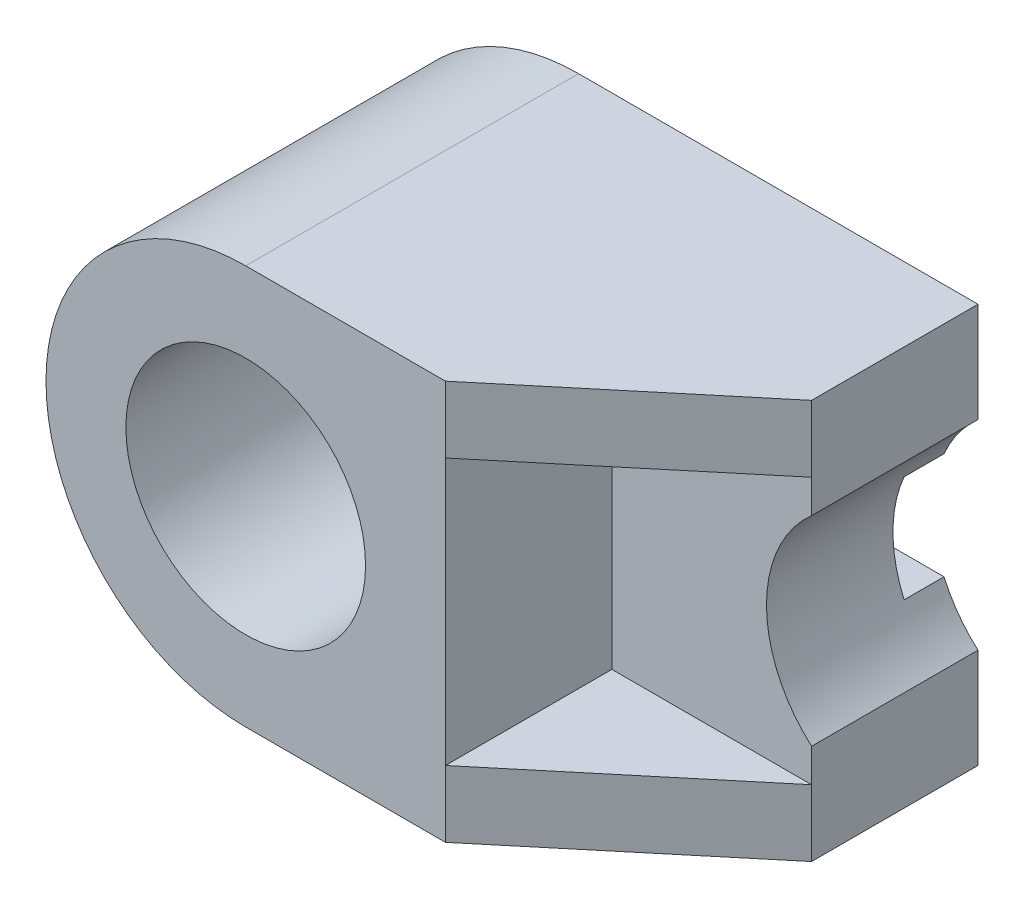
ISO-10303-21;
HEADER;
FILE_DESCRIPTION(('STEP AP214'),'2;1');
FILE_NAME('part.step','',(''),(''),'','','');
FILE_SCHEMA(('AUTOMOTIVE_DESIGN { 1 0 10303 214 1 1 1 1 }'));
ENDSEC;
DATA;
#1=APPLICATION_CONTEXT('core data for automotive mechanical design processes');
#2=APPLICATION_PROTOCOL_DEFINITION('international standard','automotive_design',2000,#1);
#3=PRODUCT_CONTEXT('',#1,'mechanical');
#4=PRODUCT('Part','Part','',(#3));
#5=PRODUCT_RELATED_PRODUCT_CATEGORY('part','',(#4));
#6=PRODUCT_DEFINITION_FORMATION('','',#4);
#7=PRODUCT_DEFINITION_CONTEXT('part definition',#1,'design');
#8=PRODUCT_DEFINITION('design','',#6,#7);
#9=PRODUCT_DEFINITION_SHAPE('','',#8);
#10=(LENGTH_UNIT() NAMED_UNIT(*) SI_UNIT(.MILLI.,.METRE.));
#11=(NAMED_UNIT(*) PLANE_ANGLE_UNIT() SI_UNIT($,.RADIAN.));
#12=(NAMED_UNIT(*) SI_UNIT($,.STERADIAN.) SOLID_ANGLE_UNIT());
#13=UNCERTAINTY_MEASURE_WITH_UNIT(LENGTH_MEASURE(1.E-05),#10,'distance_accuracy_value','');
#14=(GEOMETRIC_REPRESENTATION_CONTEXT(3) GLOBAL_UNCERTAINTY_ASSIGNED_CONTEXT((#13)) GLOBAL_UNIT_ASSIGNED_CONTEXT((#10,
#11,#12)) REPRESENTATION_CONTEXT('',''));
#15=CARTESIAN_POINT('',(0.,0.,0.));
#16=DIRECTION('',(0.,0.,1.));
#17=DIRECTION('',(1.,0.,0.));
#18=AXIS2_PLACEMENT_3D('',#15,#16,#17);
#19=CARTESIAN_POINT('',(0.,0.,-50.));
#20=DIRECTION('',(0.,0.,-1.));
#21=DIRECTION('',(-1.,0.,0.));
#22=AXIS2_PLACEMENT_3D('',#19,#20,#21);
#23=PLANE('',#22);
#24=CARTESIAN_POINT('',(73.228756555323,0.,-50.));
#25=DIRECTION('',(0.,0.,-1.));
#26=DIRECTION('',(-1.,0.,0.));
#27=AXIS2_PLACEMENT_3D('',#24,#25,#26);
#28=CIRCLE('',#27,20.);
#29=CARTESIAN_POINT('',(60.,15.,-50.));
#30=VERTEX_POINT('',#29);
#31=CARTESIAN_POINT('',(54.8984537754996,8.,-50.));
#32=VERTEX_POINT('',#31);
#33=EDGE_CURVE('E291',#30,#32,#28,.F.);
#34=ORIENTED_EDGE('',*,*,#33,.T.);
#35=DIRECTION('',(-1.,0.,0.));
#36=VECTOR('',#35,1.);
#37=CARTESIAN_POINT('',(0.,8.,-50.));
#38=LINE('',#37,#36);
#39=CARTESIAN_POINT('',(16.1245154965971,8.,-50.));
#40=VERTEX_POINT('',#39);
#41=EDGE_CURVE('E188',#32,#40,#38,.T.);
#42=ORIENTED_EDGE('',*,*,#41,.T.);
#43=CARTESIAN_POINT('',(0.,0.,-50.));
#44=DIRECTION('',(0.,0.,1.));
#45=DIRECTION('',(1.,0.,0.));
#46=AXIS2_PLACEMENT_3D('',#43,#44,#45);
#47=CIRCLE('',#46,18.);
#48=CARTESIAN_POINT('',(-16.1245154965971,8.,-50.));
#49=VERTEX_POINT('',#48);
#50=EDGE_CURVE('E318',#40,#49,#47,.T.);
#51=ORIENTED_EDGE('',*,*,#50,.T.);
#52=DIRECTION('',(1.,0.,0.));
#53=VECTOR('',#52,1.);
#54=CARTESIAN_POINT('',(-28.9136645896019,8.,-50.));
#55=LINE('',#54,#53);
#56=CARTESIAN_POINT('',(-28.9136645896019,8.,-50.));
#57=VERTEX_POINT('',#56);
#58=EDGE_CURVE('E215',#57,#49,#55,.T.);
#59=ORIENTED_EDGE('',*,*,#58,.F.);
#60=CARTESIAN_POINT('',(0.,0.,-50.));
#61=DIRECTION('',(0.,0.,1.));
#62=DIRECTION('',(-1.,0.,0.));
#63=AXIS2_PLACEMENT_3D('',#60,#61,#62);
#64=CIRCLE('',#63,30.);
#65=CARTESIAN_POINT('',(0.,30.,-50.));
#66=VERTEX_POINT('',#65);
#67=EDGE_CURVE('E322',#66,#57,#64,.T.);
#68=ORIENTED_EDGE('',*,*,#67,.F.);
#69=DIRECTION('',(-1.,0.,0.));
#70=VECTOR('',#69,1.);
#71=CARTESIAN_POINT('',(0.,30.,-50.));
#72=LINE('',#71,#70);
#73=CARTESIAN_POINT('',(60.,30.,-50.));
#74=VERTEX_POINT('',#73);
#75=EDGE_CURVE('E330',#74,#66,#72,.T.);
#76=ORIENTED_EDGE('',*,*,#75,.F.);
#77=DIRECTION('',(0.,-1.,0.));
#78=VECTOR('',#77,1.);
#79=CARTESIAN_POINT('',(60.,0.,-50.));
#80=LINE('',#79,#78);
#81=EDGE_CURVE('E268',#74,#30,#80,.T.);
#82=ORIENTED_EDGE('',*,*,#81,.T.);
#83=EDGE_LOOP('',(#34,#42,#51,#59,#68,#76,#82));
#84=FACE_BOUND('',#83,.T.);
#85=ADVANCED_FACE('F46',(#84),#23,.T.);
#86=CARTESIAN_POINT('',(0.,0.,-50.));
#87=DIRECTION('',(0.,0.,1.));
#88=DIRECTION('',(1.,0.,0.));
#89=AXIS2_PLACEMENT_3D('',#86,#87,#88);
#90=CYLINDRICAL_SURFACE('',#89,18.);
#91=CARTESIAN_POINT('',(0.,0.,0.));
#92=DIRECTION('',(0.,0.,1.));
#93=DIRECTION('',(1.,0.,0.));
#94=AXIS2_PLACEMENT_3D('',#91,#92,#93);
#95=CIRCLE('',#94,18.);
#96=CARTESIAN_POINT('',(18.,0.,0.));
#97=VERTEX_POINT('',#96);
#98=EDGE_CURVE('E303',#97,#97,#95,.T.);
#99=ORIENTED_EDGE('',*,*,#98,.T.);
#100=EDGE_LOOP('',(#99));
#101=FACE_BOUND('',#100,.T.);
#102=DIRECTION('',(0.,0.,-1.));
#103=VECTOR('',#102,1.);
#104=CARTESIAN_POINT('',(16.1245154965971,8.,-44.));
#105=LINE('',#104,#103);
#106=CARTESIAN_POINT('',(16.1245154965971,8.,-44.));
#107=VERTEX_POINT('',#106);
#108=EDGE_CURVE('E198',#107,#40,#105,.T.);
#109=ORIENTED_EDGE('',*,*,#108,.F.);
#110=CARTESIAN_POINT('',(0.,0.,-44.));
#111=DIRECTION('',(0.,0.,-1.));
#112=DIRECTION('',(-1.,0.,0.));
#113=AXIS2_PLACEMENT_3D('',#110,#111,#112);
#114=CIRCLE('',#113,18.);
#115=CARTESIAN_POINT('',(16.1245154965971,-8.,-44.));
#116=VERTEX_POINT('',#115);
#117=EDGE_CURVE('E180',#116,#107,#114,.F.);
#118=ORIENTED_EDGE('',*,*,#117,.F.);
#119=DIRECTION('',(0.,0.,-1.));
#120=VECTOR('',#119,1.);
#121=CARTESIAN_POINT('',(16.1245154965971,-8.,-44.));
#122=LINE('',#121,#120);
#123=CARTESIAN_POINT('',(16.1245154965971,-8.,-50.));
#124=VERTEX_POINT('',#123);
#125=EDGE_CURVE('E177',#116,#124,#122,.T.);
#126=ORIENTED_EDGE('',*,*,#125,.T.);
#127=CARTESIAN_POINT('',(-16.1245154965971,-8.,-50.));
#128=VERTEX_POINT('',#127);
#129=EDGE_CURVE('E313',#128,#124,#47,.T.);
#130=ORIENTED_EDGE('',*,*,#129,.F.);
#131=DIRECTION('',(0.,0.,-1.));
#132=VECTOR('',#131,1.);
#133=CARTESIAN_POINT('',(-16.1245154965971,-8.,-44.));
#134=LINE('',#133,#132);
#135=CARTESIAN_POINT('',(-16.1245154965971,-8.,-44.));
#136=VERTEX_POINT('',#135);
#137=EDGE_CURVE('E230',#136,#128,#134,.T.);
#138=ORIENTED_EDGE('',*,*,#137,.F.);
#139=CARTESIAN_POINT('',(0.,0.,-44.));
#140=DIRECTION('',(0.,0.,-1.));
#141=DIRECTION('',(-1.,0.,0.));
#142=AXIS2_PLACEMENT_3D('',#139,#140,#141);
#143=CIRCLE('',#142,18.);
#144=CARTESIAN_POINT('',(-16.1245154965971,8.,-44.));
#145=VERTEX_POINT('',#144);
#146=EDGE_CURVE('E12',#145,#136,#143,.F.);
#147=ORIENTED_EDGE('',*,*,#146,.F.);
#148=DIRECTION('',(0.,0.,-1.));
#149=VECTOR('',#148,1.);
#150=CARTESIAN_POINT('',(-16.1245154965971,8.,-44.));
#151=LINE('',#150,#149);
#152=EDGE_CURVE('E214',#145,#49,#151,.T.);
#153=ORIENTED_EDGE('',*,*,#152,.T.);
#154=ORIENTED_EDGE('',*,*,#50,.F.);
#155=EDGE_LOOP('',(#109,#118,#126,#130,#138,#147,#153,#154));
#156=FACE_BOUND('',#155,.T.);
#157=ADVANCED_FACE('F381',(#101,#156),#90,.F.);
#158=CARTESIAN_POINT('',(73.228756555323,0.,-25.));
#159=DIRECTION('',(0.,0.,-1.));
#160=DIRECTION('',(-1.,0.,0.));
#161=AXIS2_PLACEMENT_3D('',#158,#159,#160);
#162=CYLINDRICAL_SURFACE('',#161,20.);
#163=CARTESIAN_POINT('',(73.228756555323,0.,-44.));
#164=DIRECTION('',(0.,0.,-1.));
#165=DIRECTION('',(-1.,0.,0.));
#166=AXIS2_PLACEMENT_3D('',#163,#164,#165);
#167=CIRCLE('',#166,20.);
#168=CARTESIAN_POINT('',(54.8984537754996,8.,-44.));
#169=VERTEX_POINT('',#168);
#170=CARTESIAN_POINT('',(54.8984537754996,-8.00000000000001,-44.));
#171=VERTEX_POINT('',#170);
#172=EDGE_CURVE('E181',#169,#171,#167,.F.);
#173=ORIENTED_EDGE('',*,*,#172,.F.);
#174=DIRECTION('',(0.,0.,-1.));
#175=VECTOR('',#174,1.);
#176=CARTESIAN_POINT('',(54.8984537754996,8.,-44.));
#177=LINE('',#176,#175);
#178=EDGE_CURVE('E219',#169,#32,#177,.T.);
#179=ORIENTED_EDGE('',*,*,#178,.T.);
#180=ORIENTED_EDGE('',*,*,#33,.F.);
#181=DIRECTION('',(0.,0.,-1.));
#182=VECTOR('',#181,1.);
#183=CARTESIAN_POINT('',(60.,15.,-25.));
#184=LINE('',#183,#182);
#185=CARTESIAN_POINT('',(60.,15.,-25.));
#186=VERTEX_POINT('',#185);
#187=EDGE_CURVE('E287',#186,#30,#184,.T.);
#188=ORIENTED_EDGE('',*,*,#187,.F.);
#189=CARTESIAN_POINT('',(73.228756555323,0.,-25.));
#190=DIRECTION('',(0.,0.,-1.));
#191=DIRECTION('',(-1.,0.,0.));
#192=AXIS2_PLACEMENT_3D('',#189,#190,#191);
#193=CIRCLE('',#192,20.);
#194=CARTESIAN_POINT('',(60.,-15.,-25.));
#195=VERTEX_POINT('',#194);
#196=EDGE_CURVE('E273',#186,#195,#193,.F.);
#197=ORIENTED_EDGE('',*,*,#196,.T.);
#198=DIRECTION('',(0.,0.,-1.));
#199=VECTOR('',#198,1.);
#200=CARTESIAN_POINT('',(60.,-15.,-25.));
#201=LINE('',#200,#199);
#202=CARTESIAN_POINT('',(60.,-15.,-50.));
#203=VERTEX_POINT('',#202);
#204=EDGE_CURVE('E308',#195,#203,#201,.T.);
#205=ORIENTED_EDGE('',*,*,#204,.T.);
#206=CARTESIAN_POINT('',(54.8984537754996,-8.00000000000001,-50.));
#207=VERTEX_POINT('',#206);
#208=EDGE_CURVE('E193',#207,#203,#28,.F.);
#209=ORIENTED_EDGE('',*,*,#208,.F.);
#210=DIRECTION('',(0.,0.,-1.));
#211=VECTOR('',#210,1.);
#212=CARTESIAN_POINT('',(54.8984537754996,-8.00000000000001,-44.));
#213=LINE('',#212,#211);
#214=EDGE_CURVE('E174',#171,#207,#213,.T.);
#215=ORIENTED_EDGE('',*,*,#214,.F.);
#216=EDGE_LOOP('',(#173,#179,#180,#188,#197,#205,#209,#215));
#217=FACE_BOUND('',#216,.T.);
#218=ADVANCED_FACE('F191',(#217),#162,.F.);
#219=CARTESIAN_POINT('',(30.,30.,-50.));
#220=DIRECTION('',(1.,0.,0.));
#221=DIRECTION('',(0.,1.,0.));
#222=AXIS2_PLACEMENT_3D('',#219,#220,#221);
#223=PLANE('',#222);
#224=DIRECTION('',(0.,1.,0.));
#225=VECTOR('',#224,1.);
#226=CARTESIAN_POINT('',(30.,30.,0.));
#227=LINE('',#226,#225);
#228=CARTESIAN_POINT('',(30.,-20.,0.));
#229=VERTEX_POINT('',#228);
#230=CARTESIAN_POINT('',(30.,20.,0.));
#231=VERTEX_POINT('',#230);
#232=EDGE_CURVE('E341',#229,#231,#227,.T.);
#233=ORIENTED_EDGE('',*,*,#232,.F.);
#234=DIRECTION('',(0.,0.,-1.));
#235=VECTOR('',#234,1.);
#236=CARTESIAN_POINT('',(30.,-20.,0.));
#237=LINE('',#236,#235);
#238=CARTESIAN_POINT('',(30.,-20.,-25.));
#239=VERTEX_POINT('',#238);
#240=EDGE_CURVE('E240',#229,#239,#237,.T.);
#241=ORIENTED_EDGE('',*,*,#240,.T.);
#242=DIRECTION('',(0.,-1.,0.));
#243=VECTOR('',#242,1.);
#244=CARTESIAN_POINT('',(30.,0.,-25.));
#245=LINE('',#244,#243);
#246=CARTESIAN_POINT('',(30.,20.,-25.));
#247=VERTEX_POINT('',#246);
#248=EDGE_CURVE('E283',#247,#239,#245,.T.);
#249=ORIENTED_EDGE('',*,*,#248,.F.);
#250=DIRECTION('',(0.,0.,-1.));
#251=VECTOR('',#250,1.);
#252=CARTESIAN_POINT('',(30.,20.,0.));
#253=LINE('',#252,#251);
#254=EDGE_CURVE('E259',#231,#247,#253,.T.);
#255=ORIENTED_EDGE('',*,*,#254,.F.);
#256=EDGE_LOOP('',(#233,#241,#249,#255));
#257=FACE_BOUND('',#256,.T.);
#258=ADVANCED_FACE('F424',(#257),#223,.T.);
#259=CARTESIAN_POINT('',(0.,0.,-25.));
#260=DIRECTION('',(0.,0.,-1.));
#261=DIRECTION('',(-1.,0.,0.));
#262=AXIS2_PLACEMENT_3D('',#259,#260,#261);
#263=PLANE('',#262);
#264=DIRECTION('',(1.,0.,0.));
#265=VECTOR('',#264,1.);
#266=CARTESIAN_POINT('',(30.,-20.,-25.));
#267=LINE('',#266,#265);
#268=CARTESIAN_POINT('',(60.,-20.,-25.));
#269=VERTEX_POINT('',#268);
#270=EDGE_CURVE('E243',#239,#269,#267,.T.);
#271=ORIENTED_EDGE('',*,*,#270,.T.);
#272=DIRECTION('',(0.,1.,0.));
#273=VECTOR('',#272,1.);
#274=CARTESIAN_POINT('',(60.,0.,-25.));
#275=LINE('',#274,#273);
#276=EDGE_CURVE('E278',#269,#195,#275,.T.);
#277=ORIENTED_EDGE('',*,*,#276,.T.);
#278=ORIENTED_EDGE('',*,*,#196,.F.);
#279=DIRECTION('',(0.,-1.,0.));
#280=VECTOR('',#279,1.);
#281=CARTESIAN_POINT('',(60.,0.,-25.));
#282=LINE('',#281,#280);
#283=CARTESIAN_POINT('',(60.,20.,-25.));
#284=VERTEX_POINT('',#283);
#285=EDGE_CURVE('E274',#284,#186,#282,.T.);
#286=ORIENTED_EDGE('',*,*,#285,.F.);
#287=DIRECTION('',(1.,0.,0.));
#288=VECTOR('',#287,1.);
#289=CARTESIAN_POINT('',(30.,20.,-25.));
#290=LINE('',#289,#288);
#291=EDGE_CURVE('E251',#247,#284,#290,.T.);
#292=ORIENTED_EDGE('',*,*,#291,.F.);
#293=ORIENTED_EDGE('',*,*,#248,.T.);
#294=EDGE_LOOP('',(#271,#277,#278,#286,#292,#293));
#295=FACE_BOUND('',#294,.T.);
#296=ADVANCED_FACE('F428',(#295),#263,.F.);
#297=CARTESIAN_POINT('',(0.,0.,-50.));
#298=DIRECTION('',(0.,0.,1.));
#299=DIRECTION('',(1.,0.,0.));
#300=AXIS2_PLACEMENT_3D('',#297,#298,#299);
#301=CYLINDRICAL_SURFACE('',#300,30.);
#302=DIRECTION('',(0.,0.,-1.));
#303=VECTOR('',#302,1.);
#304=CARTESIAN_POINT('',(-28.9136645896019,8.,-44.));
#305=LINE('',#304,#303);
#306=CARTESIAN_POINT('',(-28.9136645896019,8.,-44.));
#307=VERTEX_POINT('',#306);
#308=EDGE_CURVE('E222',#307,#57,#305,.T.);
#309=ORIENTED_EDGE('',*,*,#308,.F.);
#310=CARTESIAN_POINT('',(0.,0.,-44.));
#311=DIRECTION('',(0.,0.,1.));
#312=DIRECTION('',(1.,0.,0.));
#313=AXIS2_PLACEMENT_3D('',#310,#311,#312);
#314=CIRCLE('',#313,30.);
#315=CARTESIAN_POINT('',(-28.9136645896019,-8.,-44.));
#316=VERTEX_POINT('',#315);
#317=EDGE_CURVE('E210',#307,#316,#314,.T.);
#318=ORIENTED_EDGE('',*,*,#317,.T.);
#319=DIRECTION('',(0.,0.,-1.));
#320=VECTOR('',#319,1.);
#321=CARTESIAN_POINT('',(-28.9136645896019,-8.,-44.));
#322=LINE('',#321,#320);
#323=CARTESIAN_POINT('',(-28.9136645896019,-8.,-50.));
#324=VERTEX_POINT('',#323);
#325=EDGE_CURVE('E226',#316,#324,#322,.T.);
#326=ORIENTED_EDGE('',*,*,#325,.T.);
#327=CARTESIAN_POINT('',(0.,-30.,-50.));
#328=VERTEX_POINT('',#327);
#329=EDGE_CURVE('E327',#324,#328,#64,.T.);
#330=ORIENTED_EDGE('',*,*,#329,.T.);
#331=DIRECTION('',(0.,0.,1.));
#332=VECTOR('',#331,1.);
#333=CARTESIAN_POINT('',(0.,-30.,-50.));
#334=LINE('',#333,#332);
#335=CARTESIAN_POINT('',(0.,-30.,0.));
#336=VERTEX_POINT('',#335);
#337=EDGE_CURVE('E334',#328,#336,#334,.T.);
#338=ORIENTED_EDGE('',*,*,#337,.T.);
#339=CARTESIAN_POINT('',(0.,0.,0.));
#340=DIRECTION('',(0.,0.,1.));
#341=DIRECTION('',(-1.,0.,0.));
#342=AXIS2_PLACEMENT_3D('',#339,#340,#341);
#343=CIRCLE('',#342,30.);
#344=CARTESIAN_POINT('',(0.,30.,0.));
#345=VERTEX_POINT('',#344);
#346=EDGE_CURVE('E317',#345,#336,#343,.T.);
#347=ORIENTED_EDGE('',*,*,#346,.F.);
#348=DIRECTION('',(0.,0.,1.));
#349=VECTOR('',#348,1.);
#350=CARTESIAN_POINT('',(0.,30.,-50.));
#351=LINE('',#350,#349);
#352=EDGE_CURVE('E55',#66,#345,#351,.T.);
#353=ORIENTED_EDGE('',*,*,#352,.F.);
#354=ORIENTED_EDGE('',*,*,#67,.T.);
#355=EDGE_LOOP('',(#309,#318,#326,#330,#338,#347,#353,#354));
#356=FACE_BOUND('',#355,.T.);
#357=ADVANCED_FACE('F48',(#356),#301,.T.);
#358=CARTESIAN_POINT('',(0.,30.,-50.));
#359=DIRECTION('',(0.,1.,0.));
#360=DIRECTION('',(0.,0.,1.));
#361=AXIS2_PLACEMENT_3D('',#358,#359,#360);
#362=PLANE('',#361);
#363=DIRECTION('',(-1.,0.,0.));
#364=VECTOR('',#363,1.);
#365=CARTESIAN_POINT('',(0.,30.,0.));
#366=LINE('',#365,#364);
#367=CARTESIAN_POINT('',(30.,30.,0.));
#368=VERTEX_POINT('',#367);
#369=EDGE_CURVE('E346',#368,#345,#366,.T.);
#370=ORIENTED_EDGE('',*,*,#369,.F.);
#371=DIRECTION('',(-0.768221279597376,0.,0.64018439966448));
#372=VECTOR('',#371,1.);
#373=CARTESIAN_POINT('',(60.,30.,-25.));
#374=LINE('',#373,#372);
#375=CARTESIAN_POINT('',(60.,30.,-25.));
#376=VERTEX_POINT('',#375);
#377=EDGE_CURVE('E247',#376,#368,#374,.T.);
#378=ORIENTED_EDGE('',*,*,#377,.F.);
#379=DIRECTION('',(0.,0.,-1.));
#380=VECTOR('',#379,1.);
#381=CARTESIAN_POINT('',(60.,30.,-25.));
#382=LINE('',#381,#380);
#383=EDGE_CURVE('E299',#376,#74,#382,.T.);
#384=ORIENTED_EDGE('',*,*,#383,.T.);
#385=ORIENTED_EDGE('',*,*,#75,.T.);
#386=ORIENTED_EDGE('',*,*,#352,.T.);
#387=EDGE_LOOP('',(#370,#378,#384,#385,#386));
#388=FACE_BOUND('',#387,.T.);
#389=ADVANCED_FACE('F369',(#388),#362,.T.);
#390=CARTESIAN_POINT('',(30.,-30.,-50.));
#391=DIRECTION('',(0.,-1.,0.));
#392=DIRECTION('',(1.,0.,0.));
#393=AXIS2_PLACEMENT_3D('',#390,#391,#392);
#394=PLANE('',#393);
#395=DIRECTION('',(0.,0.,-1.));
#396=VECTOR('',#395,1.);
#397=CARTESIAN_POINT('',(60.,-30.,-25.));
#398=LINE('',#397,#396);
#399=CARTESIAN_POINT('',(60.,-30.,-25.));
#400=VERTEX_POINT('',#399);
#401=CARTESIAN_POINT('',(60.,-30.,-50.));
#402=VERTEX_POINT('',#401);
#403=EDGE_CURVE('E304',#400,#402,#398,.T.);
#404=ORIENTED_EDGE('',*,*,#403,.F.);
#405=DIRECTION('',(-0.768221279597376,0.,0.64018439966448));
#406=VECTOR('',#405,1.);
#407=CARTESIAN_POINT('',(60.,-30.,-25.));
#408=LINE('',#407,#406);
#409=CARTESIAN_POINT('',(30.,-30.,0.));
#410=VERTEX_POINT('',#409);
#411=EDGE_CURVE('E225',#400,#410,#408,.T.);
#412=ORIENTED_EDGE('',*,*,#411,.T.);
#413=DIRECTION('',(1.,0.,0.));
#414=VECTOR('',#413,1.);
#415=CARTESIAN_POINT('',(30.,-30.,0.));
#416=LINE('',#415,#414);
#417=EDGE_CURVE('E338',#336,#410,#416,.T.);
#418=ORIENTED_EDGE('',*,*,#417,.F.);
#419=ORIENTED_EDGE('',*,*,#337,.F.);
#420=DIRECTION('',(1.,0.,0.));
#421=VECTOR('',#420,1.);
#422=CARTESIAN_POINT('',(30.,-30.,-50.));
#423=LINE('',#422,#421);
#424=EDGE_CURVE('E326',#328,#402,#423,.T.);
#425=ORIENTED_EDGE('',*,*,#424,.T.);
#426=EDGE_LOOP('',(#404,#412,#418,#419,#425));
#427=FACE_BOUND('',#426,.T.);
#428=ADVANCED_FACE('F360',(#427),#394,.T.);
#429=DIRECTION('',(-1.,0.,0.));
#430=VECTOR('',#429,1.);
#431=CARTESIAN_POINT('',(0.,-8.,-50.));
#432=LINE('',#431,#430);
#433=EDGE_CURVE('E405',#207,#124,#432,.T.);
#434=ORIENTED_EDGE('',*,*,#433,.F.);
#435=ORIENTED_EDGE('',*,*,#208,.T.);
#436=DIRECTION('',(0.,1.,0.));
#437=VECTOR('',#436,1.);
#438=CARTESIAN_POINT('',(60.,0.,-50.));
#439=LINE('',#438,#437);
#440=EDGE_CURVE('E295',#402,#203,#439,.T.);
#441=ORIENTED_EDGE('',*,*,#440,.F.);
#442=ORIENTED_EDGE('',*,*,#424,.F.);
#443=ORIENTED_EDGE('',*,*,#329,.F.);
#444=DIRECTION('',(-1.,0.,0.));
#445=VECTOR('',#444,1.);
#446=CARTESIAN_POINT('',(-16.1245154965971,-8.,-50.));
#447=LINE('',#446,#445);
#448=EDGE_CURVE('E206',#128,#324,#447,.T.);
#449=ORIENTED_EDGE('',*,*,#448,.F.);
#450=ORIENTED_EDGE('',*,*,#129,.T.);
#451=EDGE_LOOP('',(#434,#435,#441,#442,#443,#449,#450));
#452=FACE_BOUND('',#451,.T.);
#453=ADVANCED_FACE('F390',(#452),#23,.T.);
#454=CARTESIAN_POINT('',(0.,0.,0.));
#455=DIRECTION('',(0.,0.,-1.));
#456=DIRECTION('',(-1.,0.,0.));
#457=AXIS2_PLACEMENT_3D('',#454,#455,#456);
#458=PLANE('',#457);
#459=ORIENTED_EDGE('',*,*,#98,.F.);
#460=EDGE_LOOP('',(#459));
#461=FACE_BOUND('',#460,.T.);
#462=ORIENTED_EDGE('',*,*,#346,.T.);
#463=ORIENTED_EDGE('',*,*,#417,.T.);
#464=EDGE_CURVE('E342',#410,#229,#227,.T.);
#465=ORIENTED_EDGE('',*,*,#464,.T.);
#466=ORIENTED_EDGE('',*,*,#232,.T.);
#467=DIRECTION('',(0.,1.,0.));
#468=VECTOR('',#467,1.);
#469=CARTESIAN_POINT('',(30.,20.,0.));
#470=LINE('',#469,#468);
#471=EDGE_CURVE('E262',#231,#368,#470,.T.);
#472=ORIENTED_EDGE('',*,*,#471,.T.);
#473=ORIENTED_EDGE('',*,*,#369,.T.);
#474=EDGE_LOOP('',(#462,#463,#465,#466,#472,#473));
#475=FACE_BOUND('',#474,.T.);
#476=ADVANCED_FACE('F364',(#461,#475),#458,.F.);
#477=CARTESIAN_POINT('',(60.,0.,-25.));
#478=DIRECTION('',(1.,0.,0.));
#479=DIRECTION('',(0.,0.,-1.));
#480=AXIS2_PLACEMENT_3D('',#477,#478,#479);
#481=PLANE('',#480);
#482=ORIENTED_EDGE('',*,*,#81,.F.);
#483=ORIENTED_EDGE('',*,*,#383,.F.);
#484=EDGE_CURVE('E269',#376,#284,#282,.T.);
#485=ORIENTED_EDGE('',*,*,#484,.T.);
#486=ORIENTED_EDGE('',*,*,#285,.T.);
#487=ORIENTED_EDGE('',*,*,#187,.T.);
#488=EDGE_LOOP('',(#482,#483,#485,#486,#487));
#489=FACE_BOUND('',#488,.T.);
#490=ADVANCED_FACE('F436',(#489),#481,.T.);
#491=CARTESIAN_POINT('',(60.,0.,-25.));
#492=DIRECTION('',(-1.,0.,0.));
#493=DIRECTION('',(0.,0.,1.));
#494=AXIS2_PLACEMENT_3D('',#491,#492,#493);
#495=PLANE('',#494);
#496=ORIENTED_EDGE('',*,*,#440,.T.);
#497=ORIENTED_EDGE('',*,*,#204,.F.);
#498=ORIENTED_EDGE('',*,*,#276,.F.);
#499=EDGE_CURVE('E279',#400,#269,#275,.T.);
#500=ORIENTED_EDGE('',*,*,#499,.F.);
#501=ORIENTED_EDGE('',*,*,#403,.T.);
#502=EDGE_LOOP('',(#496,#497,#498,#500,#501));
#503=FACE_BOUND('',#502,.T.);
#504=ADVANCED_FACE('F413',(#503),#495,.F.);
#505=CARTESIAN_POINT('',(60.,20.,-25.));
#506=DIRECTION('',(-0.64018439966448,0.,-0.768221279597376));
#507=DIRECTION('',(-0.768221279597376,0.,0.64018439966448));
#508=AXIS2_PLACEMENT_3D('',#505,#506,#507);
#509=PLANE('',#508);
#510=ORIENTED_EDGE('',*,*,#377,.T.);
#511=ORIENTED_EDGE('',*,*,#471,.F.);
#512=DIRECTION('',(-0.768221279597376,0.,0.64018439966448));
#513=VECTOR('',#512,1.);
#514=CARTESIAN_POINT('',(60.,20.,-25.));
#515=LINE('',#514,#513);
#516=EDGE_CURVE('E255',#284,#231,#515,.T.);
#517=ORIENTED_EDGE('',*,*,#516,.F.);
#518=ORIENTED_EDGE('',*,*,#484,.F.);
#519=EDGE_LOOP('',(#510,#511,#517,#518));
#520=FACE_BOUND('',#519,.T.);
#521=ADVANCED_FACE('F433',(#520),#509,.F.);
#522=CARTESIAN_POINT('',(0.,20.,0.));
#523=DIRECTION('',(0.,1.,0.));
#524=DIRECTION('',(0.,0.,1.));
#525=AXIS2_PLACEMENT_3D('',#522,#523,#524);
#526=PLANE('',#525);
#527=ORIENTED_EDGE('',*,*,#291,.T.);
#528=ORIENTED_EDGE('',*,*,#516,.T.);
#529=ORIENTED_EDGE('',*,*,#254,.T.);
#530=EDGE_LOOP('',(#527,#528,#529));
#531=FACE_BOUND('',#530,.T.);
#532=ADVANCED_FACE('F431',(#531),#526,.F.);
#533=CARTESIAN_POINT('',(60.,-20.,-25.));
#534=DIRECTION('',(0.64018439966448,0.,0.768221279597376));
#535=DIRECTION('',(0.768221279597376,0.,-0.64018439966448));
#536=AXIS2_PLACEMENT_3D('',#533,#534,#535);
#537=PLANE('',#536);
#538=ORIENTED_EDGE('',*,*,#411,.F.);
#539=ORIENTED_EDGE('',*,*,#499,.T.);
#540=DIRECTION('',(-0.768221279597376,0.,0.64018439966448));
#541=VECTOR('',#540,1.);
#542=CARTESIAN_POINT('',(60.,-20.,-25.));
#543=LINE('',#542,#541);
#544=EDGE_CURVE('E236',#269,#229,#543,.T.);
#545=ORIENTED_EDGE('',*,*,#544,.T.);
#546=ORIENTED_EDGE('',*,*,#464,.F.);
#547=EDGE_LOOP('',(#538,#539,#545,#546));
#548=FACE_BOUND('',#547,.T.);
#549=ADVANCED_FACE('F417',(#548),#537,.T.);
#550=CARTESIAN_POINT('',(0.,-20.,0.));
#551=DIRECTION('',(0.,-1.,0.));
#552=DIRECTION('',(1.,0.,0.));
#553=AXIS2_PLACEMENT_3D('',#550,#551,#552);
#554=PLANE('',#553);
#555=ORIENTED_EDGE('',*,*,#544,.F.);
#556=ORIENTED_EDGE('',*,*,#270,.F.);
#557=ORIENTED_EDGE('',*,*,#240,.F.);
#558=EDGE_LOOP('',(#555,#556,#557));
#559=FACE_BOUND('',#558,.T.);
#560=ADVANCED_FACE('F421',(#559),#554,.F.);
#561=CARTESIAN_POINT('',(0.,0.,-44.));
#562=DIRECTION('',(0.,0.,-1.));
#563=DIRECTION('',(-1.,0.,0.));
#564=AXIS2_PLACEMENT_3D('',#561,#562,#563);
#565=PLANE('',#564);
#566=ORIENTED_EDGE('',*,*,#146,.T.);
#567=DIRECTION('',(-1.,0.,0.));
#568=VECTOR('',#567,1.);
#569=CARTESIAN_POINT('',(-16.1245154965971,-8.,-44.));
#570=LINE('',#569,#568);
#571=EDGE_CURVE('E205',#136,#316,#570,.T.);
#572=ORIENTED_EDGE('',*,*,#571,.T.);
#573=ORIENTED_EDGE('',*,*,#317,.F.);
#574=DIRECTION('',(1.,0.,0.));
#575=VECTOR('',#574,1.);
#576=CARTESIAN_POINT('',(-28.9136645896019,8.,-44.));
#577=LINE('',#576,#575);
#578=EDGE_CURVE('E69',#307,#145,#577,.T.);
#579=ORIENTED_EDGE('',*,*,#578,.T.);
#580=EDGE_LOOP('',(#566,#572,#573,#579));
#581=FACE_BOUND('',#580,.T.);
#582=ADVANCED_FACE('F385',(#581),#565,.T.);
#583=CARTESIAN_POINT('',(-28.9136645896019,8.,-44.));
#584=DIRECTION('',(0.,1.,0.));
#585=DIRECTION('',(0.,0.,1.));
#586=AXIS2_PLACEMENT_3D('',#583,#584,#585);
#587=PLANE('',#586);
#588=ORIENTED_EDGE('',*,*,#58,.T.);
#589=ORIENTED_EDGE('',*,*,#152,.F.);
#590=ORIENTED_EDGE('',*,*,#578,.F.);
#591=ORIENTED_EDGE('',*,*,#308,.T.);
#592=EDGE_LOOP('',(#588,#589,#590,#591));
#593=FACE_BOUND('',#592,.T.);
#594=ADVANCED_FACE('F377',(#593),#587,.F.);
#595=CARTESIAN_POINT('',(-16.1245154965971,-8.,-44.));
#596=DIRECTION('',(0.,-1.,0.));
#597=DIRECTION('',(1.,0.,0.));
#598=AXIS2_PLACEMENT_3D('',#595,#596,#597);
#599=PLANE('',#598);
#600=ORIENTED_EDGE('',*,*,#448,.T.);
#601=ORIENTED_EDGE('',*,*,#325,.F.);
#602=ORIENTED_EDGE('',*,*,#571,.F.);
#603=ORIENTED_EDGE('',*,*,#137,.T.);
#604=EDGE_LOOP('',(#600,#601,#602,#603));
#605=FACE_BOUND('',#604,.T.);
#606=ADVANCED_FACE('F387',(#605),#599,.F.);
#607=CARTESIAN_POINT('',(0.,8.,-44.));
#608=DIRECTION('',(0.,-1.,0.));
#609=DIRECTION('',(0.,0.,-1.));
#610=AXIS2_PLACEMENT_3D('',#607,#608,#609);
#611=PLANE('',#610);
#612=ORIENTED_EDGE('',*,*,#41,.F.);
#613=ORIENTED_EDGE('',*,*,#178,.F.);
#614=DIRECTION('',(-1.,0.,0.));
#615=VECTOR('',#614,1.);
#616=CARTESIAN_POINT('',(0.,8.,-44.));
#617=LINE('',#616,#615);
#618=EDGE_CURVE('E62',#169,#107,#617,.T.);
#619=ORIENTED_EDGE('',*,*,#618,.T.);
#620=ORIENTED_EDGE('',*,*,#108,.T.);
#621=EDGE_LOOP('',(#612,#613,#619,#620));
#622=FACE_BOUND('',#621,.T.);
#623=ADVANCED_FACE('F438',(#622),#611,.T.);
#624=CARTESIAN_POINT('',(0.,-8.,-44.));
#625=DIRECTION('',(0.,-1.,0.));
#626=DIRECTION('',(1.,0.,0.));
#627=AXIS2_PLACEMENT_3D('',#624,#625,#626);
#628=PLANE('',#627);
#629=ORIENTED_EDGE('',*,*,#433,.T.);
#630=ORIENTED_EDGE('',*,*,#125,.F.);
#631=DIRECTION('',(-1.,0.,0.));
#632=VECTOR('',#631,1.);
#633=CARTESIAN_POINT('',(0.,-8.,-44.));
#634=LINE('',#633,#632);
#635=EDGE_CURVE('E171',#171,#116,#634,.T.);
#636=ORIENTED_EDGE('',*,*,#635,.F.);
#637=ORIENTED_EDGE('',*,*,#214,.T.);
#638=EDGE_LOOP('',(#629,#630,#636,#637));
#639=FACE_BOUND('',#638,.T.);
#640=ADVANCED_FACE('F172',(#639),#628,.F.);
#641=CARTESIAN_POINT('',(0.,0.,-44.));
#642=DIRECTION('',(0.,0.,-1.));
#643=DIRECTION('',(-1.,0.,0.));
#644=AXIS2_PLACEMENT_3D('',#641,#642,#643);
#645=PLANE('',#644);
#646=ORIENTED_EDGE('',*,*,#172,.T.);
#647=ORIENTED_EDGE('',*,*,#635,.T.);
#648=ORIENTED_EDGE('',*,*,#117,.T.);
#649=ORIENTED_EDGE('',*,*,#618,.F.);
#650=EDGE_LOOP('',(#646,#647,#648,#649));
#651=FACE_BOUND('',#650,.T.);
#652=ADVANCED_FACE('F184',(#651),#645,.T.);
#653=CLOSED_SHELL('',(#85,#157,#218,#258,#296,#357,#389,#428,#453,#476,#490,#504,#521,#532,#549,
#560,#582,#594,#606,#623,#640,#652));
#654=MANIFOLD_SOLID_BREP('B2',#653);
#655=ADVANCED_BREP_SHAPE_REPRESENTATION('',(#18,#654),#14);
#656=SHAPE_DEFINITION_REPRESENTATION(#9,#655);
ENDSEC;
END-ISO-10303-21;
